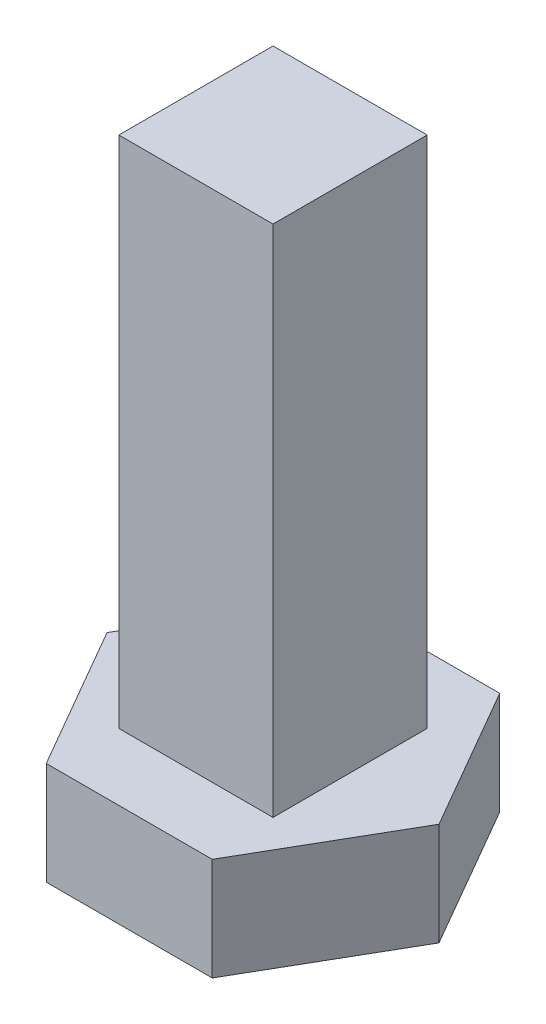
ISO-10303-21;
HEADER;
FILE_DESCRIPTION(('STEP AP214'),'2;1');
FILE_NAME('part.step','',(''),(''),'','','');
FILE_SCHEMA(('AUTOMOTIVE_DESIGN { 1 0 10303 214 1 1 1 1 }'));
ENDSEC;
DATA;
#1=APPLICATION_CONTEXT('core data for automotive mechanical design processes');
#2=APPLICATION_PROTOCOL_DEFINITION('international standard','automotive_design',2000,#1);
#3=PRODUCT_CONTEXT('',#1,'mechanical');
#4=PRODUCT('Part','Part','',(#3));
#5=PRODUCT_RELATED_PRODUCT_CATEGORY('part','',(#4));
#6=PRODUCT_DEFINITION_FORMATION('','',#4);
#7=PRODUCT_DEFINITION_CONTEXT('part definition',#1,'design');
#8=PRODUCT_DEFINITION('design','',#6,#7);
#9=PRODUCT_DEFINITION_SHAPE('','',#8);
#10=(LENGTH_UNIT() NAMED_UNIT(*) SI_UNIT(.MILLI.,.METRE.));
#11=(NAMED_UNIT(*) PLANE_ANGLE_UNIT() SI_UNIT($,.RADIAN.));
#12=(NAMED_UNIT(*) SI_UNIT($,.STERADIAN.) SOLID_ANGLE_UNIT());
#13=UNCERTAINTY_MEASURE_WITH_UNIT(LENGTH_MEASURE(1.E-05),#10,'distance_accuracy_value','');
#14=(GEOMETRIC_REPRESENTATION_CONTEXT(3) GLOBAL_UNCERTAINTY_ASSIGNED_CONTEXT((#13)) GLOBAL_UNIT_ASSIGNED_CONTEXT((#10,
#11,#12)) REPRESENTATION_CONTEXT('',''));
#15=CARTESIAN_POINT('',(0.,0.,0.));
#16=DIRECTION('',(0.,0.,1.));
#17=DIRECTION('',(1.,0.,0.));
#18=AXIS2_PLACEMENT_3D('',#15,#16,#17);
#19=CARTESIAN_POINT('',(0.,2.,0.));
#20=DIRECTION('',(0.,1.,0.));
#21=DIRECTION('',(0.,0.,1.));
#22=AXIS2_PLACEMENT_3D('',#19,#20,#21);
#23=PLANE('',#22);
#24=DIRECTION('',(0.499999999999995,0.,-0.866025403784442));
#25=VECTOR('',#24,1.);
#26=CARTESIAN_POINT('',(1.61500000000003,2.,2.79726205422371));
#27=LINE('',#26,#25);
#28=CARTESIAN_POINT('',(1.61500000000003,2.,2.79726205422371));
#29=VERTEX_POINT('',#28);
#30=CARTESIAN_POINT('',(3.22999999999999,2.,0.));
#31=VERTEX_POINT('',#30);
#32=EDGE_CURVE('E141',#29,#31,#27,.T.);
#33=ORIENTED_EDGE('',*,*,#32,.T.);
#34=DIRECTION('',(-0.500000000000001,0.,-0.866025403784438));
#35=VECTOR('',#34,1.);
#36=CARTESIAN_POINT('',(3.22999999999999,2.,0.));
#37=LINE('',#36,#35);
#38=CARTESIAN_POINT('',(1.61499999999999,2.,-2.79726205422373));
#39=VERTEX_POINT('',#38);
#40=EDGE_CURVE('E91',#31,#39,#37,.T.);
#41=ORIENTED_EDGE('',*,*,#40,.T.);
#42=DIRECTION('',(-1.,0.,0.));
#43=VECTOR('',#42,1.);
#44=CARTESIAN_POINT('',(1.61499999999999,2.,-2.79726205422373));
#45=LINE('',#44,#43);
#46=CARTESIAN_POINT('',(-1.61500000000001,2.,-2.79726205422372));
#47=VERTEX_POINT('',#46);
#48=EDGE_CURVE('E108',#39,#47,#45,.T.);
#49=ORIENTED_EDGE('',*,*,#48,.T.);
#50=DIRECTION('',(-0.499999999999995,0.,0.866025403784441));
#51=VECTOR('',#50,1.);
#52=CARTESIAN_POINT('',(-1.61500000000001,2.,-2.79726205422372));
#53=LINE('',#52,#51);
#54=CARTESIAN_POINT('',(-3.22999999999999,2.,0.));
#55=VERTEX_POINT('',#54);
#56=EDGE_CURVE('E101',#47,#55,#53,.T.);
#57=ORIENTED_EDGE('',*,*,#56,.T.);
#58=DIRECTION('',(0.500000000000007,0.,0.866025403784435));
#59=VECTOR('',#58,1.);
#60=CARTESIAN_POINT('',(-3.22999999999999,2.,0.));
#61=LINE('',#60,#59);
#62=CARTESIAN_POINT('',(-1.61499999999997,2.,2.79726205422375));
#63=VERTEX_POINT('',#62);
#64=EDGE_CURVE('E105',#55,#63,#61,.T.);
#65=ORIENTED_EDGE('',*,*,#64,.T.);
#66=DIRECTION('',(1.,0.,0.));
#67=VECTOR('',#66,1.);
#68=CARTESIAN_POINT('',(-1.61499999999997,2.,2.79726205422375));
#69=LINE('',#68,#67);
#70=EDGE_CURVE('E56',#63,#29,#69,.T.);
#71=ORIENTED_EDGE('',*,*,#70,.T.);
#72=EDGE_LOOP('',(#33,#41,#49,#57,#65,#71));
#73=FACE_BOUND('',#72,.T.);
#74=DIRECTION('',(-1.,0.,0.));
#75=VECTOR('',#74,1.);
#76=CARTESIAN_POINT('',(-1.5,2.,-1.5));
#77=LINE('',#76,#75);
#78=CARTESIAN_POINT('',(1.5,2.,-1.5));
#79=VERTEX_POINT('',#78);
#80=CARTESIAN_POINT('',(-1.5,2.,-1.5));
#81=VERTEX_POINT('',#80);
#82=EDGE_CURVE('E173',#79,#81,#77,.T.);
#83=ORIENTED_EDGE('',*,*,#82,.F.);
#84=DIRECTION('',(0.,0.,-1.));
#85=VECTOR('',#84,1.);
#86=CARTESIAN_POINT('',(1.5,2.,-1.5));
#87=LINE('',#86,#85);
#88=CARTESIAN_POINT('',(1.5,2.,1.5));
#89=VERTEX_POINT('',#88);
#90=EDGE_CURVE('E176',#89,#79,#87,.T.);
#91=ORIENTED_EDGE('',*,*,#90,.F.);
#92=DIRECTION('',(1.,0.,0.));
#93=VECTOR('',#92,1.);
#94=CARTESIAN_POINT('',(-1.5,2.,1.5));
#95=LINE('',#94,#93);
#96=CARTESIAN_POINT('',(-1.5,2.,1.5));
#97=VERTEX_POINT('',#96);
#98=EDGE_CURVE('E168',#97,#89,#95,.T.);
#99=ORIENTED_EDGE('',*,*,#98,.F.);
#100=DIRECTION('',(0.,0.,1.));
#101=VECTOR('',#100,1.);
#102=CARTESIAN_POINT('',(-1.5,2.,-1.5));
#103=LINE('',#102,#101);
#104=EDGE_CURVE('E171',#81,#97,#103,.T.);
#105=ORIENTED_EDGE('',*,*,#104,.F.);
#106=EDGE_LOOP('',(#83,#91,#99,#105));
#107=FACE_BOUND('',#106,.T.);
#108=ADVANCED_FACE('F32',(#73,#107),#23,.T.);
#109=CARTESIAN_POINT('',(1.61500000000003,2.,2.79726205422371));
#110=DIRECTION('',(-0.866025403784442,0.,-0.499999999999995));
#111=DIRECTION('',(-0.499999999999995,0.,0.866025403784442));
#112=AXIS2_PLACEMENT_3D('',#109,#110,#111);
#113=PLANE('',#112);
#114=DIRECTION('',(0.499999999999995,0.,-0.866025403784442));
#115=VECTOR('',#114,1.);
#116=CARTESIAN_POINT('',(1.61500000000003,0.,2.79726205422371));
#117=LINE('',#116,#115);
#118=CARTESIAN_POINT('',(1.61500000000003,0.,2.79726205422371));
#119=VERTEX_POINT('',#118);
#120=CARTESIAN_POINT('',(3.22999999999999,0.,0.));
#121=VERTEX_POINT('',#120);
#122=EDGE_CURVE('E129',#119,#121,#117,.T.);
#123=ORIENTED_EDGE('',*,*,#122,.T.);
#124=DIRECTION('',(0.,-1.,0.));
#125=VECTOR('',#124,1.);
#126=CARTESIAN_POINT('',(3.22999999999999,2.,0.));
#127=LINE('',#126,#125);
#128=EDGE_CURVE('E11',#31,#121,#127,.T.);
#129=ORIENTED_EDGE('',*,*,#128,.F.);
#130=ORIENTED_EDGE('',*,*,#32,.F.);
#131=DIRECTION('',(0.,-1.,0.));
#132=VECTOR('',#131,1.);
#133=CARTESIAN_POINT('',(1.61500000000003,2.,2.79726205422371));
#134=LINE('',#133,#132);
#135=EDGE_CURVE('E125',#29,#119,#134,.T.);
#136=ORIENTED_EDGE('',*,*,#135,.T.);
#137=EDGE_LOOP('',(#123,#129,#130,#136));
#138=FACE_BOUND('',#137,.T.);
#139=ADVANCED_FACE('F34',(#138),#113,.F.);
#140=CARTESIAN_POINT('',(3.22999999999999,2.,0.));
#141=DIRECTION('',(-0.866025403784438,0.,0.500000000000001));
#142=DIRECTION('',(0.500000000000001,0.,0.866025403784438));
#143=AXIS2_PLACEMENT_3D('',#140,#141,#142);
#144=PLANE('',#143);
#145=DIRECTION('',(-0.500000000000001,0.,-0.866025403784438));
#146=VECTOR('',#145,1.);
#147=CARTESIAN_POINT('',(3.22999999999999,0.,0.));
#148=LINE('',#147,#146);
#149=CARTESIAN_POINT('',(1.61499999999999,0.,-2.79726205422373));
#150=VERTEX_POINT('',#149);
#151=EDGE_CURVE('E132',#121,#150,#148,.T.);
#152=ORIENTED_EDGE('',*,*,#151,.T.);
#153=DIRECTION('',(0.,-1.,0.));
#154=VECTOR('',#153,1.);
#155=CARTESIAN_POINT('',(1.61499999999999,2.,-2.79726205422373));
#156=LINE('',#155,#154);
#157=EDGE_CURVE('E40',#39,#150,#156,.T.);
#158=ORIENTED_EDGE('',*,*,#157,.F.);
#159=ORIENTED_EDGE('',*,*,#40,.F.);
#160=ORIENTED_EDGE('',*,*,#128,.T.);
#161=EDGE_LOOP('',(#152,#158,#159,#160));
#162=FACE_BOUND('',#161,.T.);
#163=ADVANCED_FACE('F222',(#162),#144,.F.);
#164=CARTESIAN_POINT('',(1.61499999999999,2.,-2.79726205422373));
#165=DIRECTION('',(0.,0.,1.));
#166=DIRECTION('',(1.,0.,0.));
#167=AXIS2_PLACEMENT_3D('',#164,#165,#166);
#168=PLANE('',#167);
#169=DIRECTION('',(-1.,0.,0.));
#170=VECTOR('',#169,1.);
#171=CARTESIAN_POINT('',(1.61499999999999,0.,-2.79726205422373));
#172=LINE('',#171,#170);
#173=CARTESIAN_POINT('',(-1.61500000000001,0.,-2.79726205422372));
#174=VERTEX_POINT('',#173);
#175=EDGE_CURVE('E135',#150,#174,#172,.T.);
#176=ORIENTED_EDGE('',*,*,#175,.T.);
#177=DIRECTION('',(0.,-1.,0.));
#178=VECTOR('',#177,1.);
#179=CARTESIAN_POINT('',(-1.61500000000001,2.,-2.79726205422372));
#180=LINE('',#179,#178);
#181=EDGE_CURVE('E120',#47,#174,#180,.T.);
#182=ORIENTED_EDGE('',*,*,#181,.F.);
#183=ORIENTED_EDGE('',*,*,#48,.F.);
#184=ORIENTED_EDGE('',*,*,#157,.T.);
#185=EDGE_LOOP('',(#176,#182,#183,#184));
#186=FACE_BOUND('',#185,.T.);
#187=ADVANCED_FACE('F147',(#186),#168,.F.);
#188=CARTESIAN_POINT('',(-1.61500000000001,2.,-2.79726205422372));
#189=DIRECTION('',(0.866025403784441,0.,0.499999999999995));
#190=DIRECTION('',(0.499999999999995,0.,-0.866025403784442));
#191=AXIS2_PLACEMENT_3D('',#188,#189,#190);
#192=PLANE('',#191);
#193=DIRECTION('',(-0.499999999999995,0.,0.866025403784441));
#194=VECTOR('',#193,1.);
#195=CARTESIAN_POINT('',(-1.61500000000001,0.,-2.79726205422372));
#196=LINE('',#195,#194);
#197=CARTESIAN_POINT('',(-3.22999999999999,0.,0.));
#198=VERTEX_POINT('',#197);
#199=EDGE_CURVE('E117',#174,#198,#196,.T.);
#200=ORIENTED_EDGE('',*,*,#199,.T.);
#201=DIRECTION('',(0.,-1.,0.));
#202=VECTOR('',#201,1.);
#203=CARTESIAN_POINT('',(-3.22999999999999,2.,0.));
#204=LINE('',#203,#202);
#205=EDGE_CURVE('E114',#55,#198,#204,.T.);
#206=ORIENTED_EDGE('',*,*,#205,.F.);
#207=ORIENTED_EDGE('',*,*,#56,.F.);
#208=ORIENTED_EDGE('',*,*,#181,.T.);
#209=EDGE_LOOP('',(#200,#206,#207,#208));
#210=FACE_BOUND('',#209,.T.);
#211=ADVANCED_FACE('F115',(#210),#192,.F.);
#212=CARTESIAN_POINT('',(-3.22999999999999,2.,0.));
#213=DIRECTION('',(0.866025403784435,0.,-0.500000000000007));
#214=DIRECTION('',(-0.500000000000007,0.,-0.866025403784435));
#215=AXIS2_PLACEMENT_3D('',#212,#213,#214);
#216=PLANE('',#215);
#217=DIRECTION('',(0.500000000000007,0.,0.866025403784435));
#218=VECTOR('',#217,1.);
#219=CARTESIAN_POINT('',(-3.22999999999999,0.,0.));
#220=LINE('',#219,#218);
#221=CARTESIAN_POINT('',(-1.61499999999997,0.,2.79726205422375));
#222=VERTEX_POINT('',#221);
#223=EDGE_CURVE('E138',#198,#222,#220,.T.);
#224=ORIENTED_EDGE('',*,*,#223,.T.);
#225=DIRECTION('',(0.,-1.,0.));
#226=VECTOR('',#225,1.);
#227=CARTESIAN_POINT('',(-1.61499999999997,2.,2.79726205422375));
#228=LINE('',#227,#226);
#229=EDGE_CURVE('E121',#63,#222,#228,.T.);
#230=ORIENTED_EDGE('',*,*,#229,.F.);
#231=ORIENTED_EDGE('',*,*,#64,.F.);
#232=ORIENTED_EDGE('',*,*,#205,.T.);
#233=EDGE_LOOP('',(#224,#230,#231,#232));
#234=FACE_BOUND('',#233,.T.);
#235=ADVANCED_FACE('F123',(#234),#216,.F.);
#236=CARTESIAN_POINT('',(-1.61499999999997,2.,2.79726205422375));
#237=DIRECTION('',(0.,0.,-1.));
#238=DIRECTION('',(-1.,0.,0.));
#239=AXIS2_PLACEMENT_3D('',#236,#237,#238);
#240=PLANE('',#239);
#241=DIRECTION('',(1.,0.,0.));
#242=VECTOR('',#241,1.);
#243=CARTESIAN_POINT('',(-1.61499999999997,0.,2.79726205422375));
#244=LINE('',#243,#242);
#245=EDGE_CURVE('E83',#222,#119,#244,.T.);
#246=ORIENTED_EDGE('',*,*,#245,.T.);
#247=ORIENTED_EDGE('',*,*,#135,.F.);
#248=ORIENTED_EDGE('',*,*,#70,.F.);
#249=ORIENTED_EDGE('',*,*,#229,.T.);
#250=EDGE_LOOP('',(#246,#247,#248,#249));
#251=FACE_BOUND('',#250,.T.);
#252=ADVANCED_FACE('F151',(#251),#240,.F.);
#253=CARTESIAN_POINT('',(0.,0.,0.));
#254=DIRECTION('',(0.,1.,0.));
#255=DIRECTION('',(0.,0.,1.));
#256=AXIS2_PLACEMENT_3D('',#253,#254,#255);
#257=PLANE('',#256);
#258=ORIENTED_EDGE('',*,*,#122,.F.);
#259=ORIENTED_EDGE('',*,*,#245,.F.);
#260=ORIENTED_EDGE('',*,*,#223,.F.);
#261=ORIENTED_EDGE('',*,*,#199,.F.);
#262=ORIENTED_EDGE('',*,*,#175,.F.);
#263=ORIENTED_EDGE('',*,*,#151,.F.);
#264=EDGE_LOOP('',(#258,#259,#260,#261,#262,#263));
#265=FACE_BOUND('',#264,.T.);
#266=ADVANCED_FACE('F150',(#265),#257,.F.);
#267=CARTESIAN_POINT('',(1.5,12.,-1.5));
#268=DIRECTION('',(-1.,0.,0.));
#269=DIRECTION('',(0.,0.,1.));
#270=AXIS2_PLACEMENT_3D('',#267,#268,#269);
#271=PLANE('',#270);
#272=ORIENTED_EDGE('',*,*,#90,.T.);
#273=DIRECTION('',(0.,-1.,0.));
#274=VECTOR('',#273,1.);
#275=CARTESIAN_POINT('',(1.5,12.,-1.5));
#276=LINE('',#275,#274);
#277=CARTESIAN_POINT('',(1.5,12.,-1.5));
#278=VERTEX_POINT('',#277);
#279=EDGE_CURVE('E133',#278,#79,#276,.T.);
#280=ORIENTED_EDGE('',*,*,#279,.F.);
#281=DIRECTION('',(0.,0.,-1.));
#282=VECTOR('',#281,1.);
#283=CARTESIAN_POINT('',(1.5,12.,-1.5));
#284=LINE('',#283,#282);
#285=CARTESIAN_POINT('',(1.5,12.,1.5));
#286=VERTEX_POINT('',#285);
#287=EDGE_CURVE('E170',#286,#278,#284,.T.);
#288=ORIENTED_EDGE('',*,*,#287,.F.);
#289=DIRECTION('',(0.,-1.,0.));
#290=VECTOR('',#289,1.);
#291=CARTESIAN_POINT('',(1.5,12.,1.5));
#292=LINE('',#291,#290);
#293=EDGE_CURVE('E164',#286,#89,#292,.T.);
#294=ORIENTED_EDGE('',*,*,#293,.T.);
#295=EDGE_LOOP('',(#272,#280,#288,#294));
#296=FACE_BOUND('',#295,.T.);
#297=ADVANCED_FACE('F199',(#296),#271,.F.);
#298=CARTESIAN_POINT('',(-1.5,12.,-1.5));
#299=DIRECTION('',(0.,0.,1.));
#300=DIRECTION('',(1.,0.,0.));
#301=AXIS2_PLACEMENT_3D('',#298,#299,#300);
#302=PLANE('',#301);
#303=ORIENTED_EDGE('',*,*,#82,.T.);
#304=DIRECTION('',(0.,-1.,0.));
#305=VECTOR('',#304,1.);
#306=CARTESIAN_POINT('',(-1.5,12.,-1.5));
#307=LINE('',#306,#305);
#308=CARTESIAN_POINT('',(-1.5,12.,-1.5));
#309=VERTEX_POINT('',#308);
#310=EDGE_CURVE('E160',#309,#81,#307,.T.);
#311=ORIENTED_EDGE('',*,*,#310,.F.);
#312=DIRECTION('',(-1.,0.,0.));
#313=VECTOR('',#312,1.);
#314=CARTESIAN_POINT('',(-1.5,12.,-1.5));
#315=LINE('',#314,#313);
#316=EDGE_CURVE('E184',#278,#309,#315,.T.);
#317=ORIENTED_EDGE('',*,*,#316,.F.);
#318=ORIENTED_EDGE('',*,*,#279,.T.);
#319=EDGE_LOOP('',(#303,#311,#317,#318));
#320=FACE_BOUND('',#319,.T.);
#321=ADVANCED_FACE('F204',(#320),#302,.F.);
#322=CARTESIAN_POINT('',(-1.5,12.,-1.5));
#323=DIRECTION('',(1.,0.,0.));
#324=DIRECTION('',(0.,0.,-1.));
#325=AXIS2_PLACEMENT_3D('',#322,#323,#324);
#326=PLANE('',#325);
#327=ORIENTED_EDGE('',*,*,#104,.T.);
#328=DIRECTION('',(0.,-1.,0.));
#329=VECTOR('',#328,1.);
#330=CARTESIAN_POINT('',(-1.5,12.,1.5));
#331=LINE('',#330,#329);
#332=CARTESIAN_POINT('',(-1.5,12.,1.5));
#333=VERTEX_POINT('',#332);
#334=EDGE_CURVE('E47',#333,#97,#331,.T.);
#335=ORIENTED_EDGE('',*,*,#334,.F.);
#336=DIRECTION('',(0.,0.,1.));
#337=VECTOR('',#336,1.);
#338=CARTESIAN_POINT('',(-1.5,12.,-1.5));
#339=LINE('',#338,#337);
#340=EDGE_CURVE('E181',#309,#333,#339,.T.);
#341=ORIENTED_EDGE('',*,*,#340,.F.);
#342=ORIENTED_EDGE('',*,*,#310,.T.);
#343=EDGE_LOOP('',(#327,#335,#341,#342));
#344=FACE_BOUND('',#343,.T.);
#345=ADVANCED_FACE('F213',(#344),#326,.F.);
#346=CARTESIAN_POINT('',(-1.5,12.,1.5));
#347=DIRECTION('',(0.,0.,-1.));
#348=DIRECTION('',(-1.,0.,0.));
#349=AXIS2_PLACEMENT_3D('',#346,#347,#348);
#350=PLANE('',#349);
#351=ORIENTED_EDGE('',*,*,#98,.T.);
#352=ORIENTED_EDGE('',*,*,#293,.F.);
#353=DIRECTION('',(1.,0.,0.));
#354=VECTOR('',#353,1.);
#355=CARTESIAN_POINT('',(-1.5,12.,1.5));
#356=LINE('',#355,#354);
#357=EDGE_CURVE('E167',#333,#286,#356,.T.);
#358=ORIENTED_EDGE('',*,*,#357,.F.);
#359=ORIENTED_EDGE('',*,*,#334,.T.);
#360=EDGE_LOOP('',(#351,#352,#358,#359));
#361=FACE_BOUND('',#360,.T.);
#362=ADVANCED_FACE('F216',(#361),#350,.F.);
#363=CARTESIAN_POINT('',(0.,12.,0.));
#364=DIRECTION('',(0.,1.,0.));
#365=DIRECTION('',(0.,0.,1.));
#366=AXIS2_PLACEMENT_3D('',#363,#364,#365);
#367=PLANE('',#366);
#368=ORIENTED_EDGE('',*,*,#287,.T.);
#369=ORIENTED_EDGE('',*,*,#316,.T.);
#370=ORIENTED_EDGE('',*,*,#340,.T.);
#371=ORIENTED_EDGE('',*,*,#357,.T.);
#372=EDGE_LOOP('',(#368,#369,#370,#371));
#373=FACE_BOUND('',#372,.T.);
#374=ADVANCED_FACE('F192',(#373),#367,.T.);
#375=CLOSED_SHELL('',(#108,#139,#163,#187,#211,#235,#252,#266,#297,#321,#345,#362,#374));
#376=MANIFOLD_SOLID_BREP('B2',#375);
#377=ADVANCED_BREP_SHAPE_REPRESENTATION('',(#18,#376),#14);
#378=SHAPE_DEFINITION_REPRESENTATION(#9,#377);
ENDSEC;
END-ISO-10303-21;
